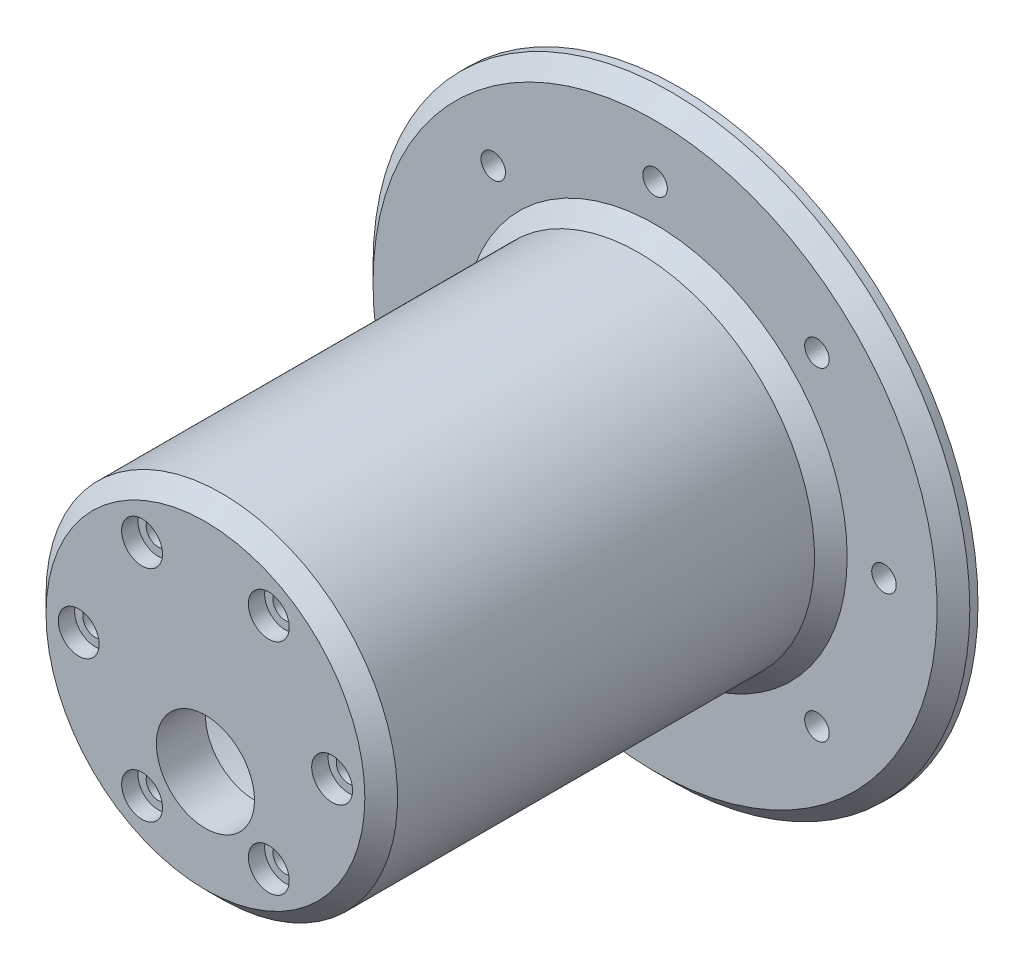
ISO-10303-21;
HEADER;
FILE_DESCRIPTION(('STEP AP214'),'2;1');
FILE_NAME('part.step','',(''),(''),'','','');
FILE_SCHEMA(('AUTOMOTIVE_DESIGN { 1 0 10303 214 1 1 1 1 }'));
ENDSEC;
DATA;
#1=APPLICATION_CONTEXT('core data for automotive mechanical design processes');
#2=APPLICATION_PROTOCOL_DEFINITION('international standard','automotive_design',2000,#1);
#3=PRODUCT_CONTEXT('',#1,'mechanical');
#4=PRODUCT('Part','Part','',(#3));
#5=PRODUCT_RELATED_PRODUCT_CATEGORY('part','',(#4));
#6=PRODUCT_DEFINITION_FORMATION('','',#4);
#7=PRODUCT_DEFINITION_CONTEXT('part definition',#1,'design');
#8=PRODUCT_DEFINITION('design','',#6,#7);
#9=PRODUCT_DEFINITION_SHAPE('','',#8);
#10=(LENGTH_UNIT() NAMED_UNIT(*) SI_UNIT(.MILLI.,.METRE.));
#11=(NAMED_UNIT(*) PLANE_ANGLE_UNIT() SI_UNIT($,.RADIAN.));
#12=(NAMED_UNIT(*) SI_UNIT($,.STERADIAN.) SOLID_ANGLE_UNIT());
#13=UNCERTAINTY_MEASURE_WITH_UNIT(LENGTH_MEASURE(1.E-05),#10,'distance_accuracy_value','');
#14=(GEOMETRIC_REPRESENTATION_CONTEXT(3) GLOBAL_UNCERTAINTY_ASSIGNED_CONTEXT((#13)) GLOBAL_UNIT_ASSIGNED_CONTEXT((#10,
#11,#12)) REPRESENTATION_CONTEXT('',''));
#15=CARTESIAN_POINT('',(0.,0.,0.));
#16=DIRECTION('',(0.,0.,1.));
#17=DIRECTION('',(1.,0.,0.));
#18=AXIS2_PLACEMENT_3D('',#15,#16,#17);
#19=CARTESIAN_POINT('',(0.,36.5,-49.));
#20=DIRECTION('',(0.,0.,-1.));
#21=DIRECTION('',(-1.,0.,0.));
#22=AXIS2_PLACEMENT_3D('',#19,#20,#21);
#23=PLANE('',#22);
#24=CARTESIAN_POINT('',(0.,0.,-49.));
#25=DIRECTION('',(0.,0.,-1.));
#26=DIRECTION('',(-1.,0.,0.));
#27=AXIS2_PLACEMENT_3D('',#24,#25,#26);
#28=CIRCLE('',#27,34.5);
#29=CARTESIAN_POINT('',(-34.5,0.,-49.));
#30=VERTEX_POINT('',#29);
#31=EDGE_CURVE('E52',#30,#30,#28,.F.);
#32=ORIENTED_EDGE('',*,*,#31,.T.);
#33=EDGE_LOOP('',(#32));
#34=FACE_BOUND('',#33,.T.);
#35=CARTESIAN_POINT('',(0.,0.,-49.));
#36=DIRECTION('',(0.,0.,-1.));
#37=DIRECTION('',(-1.,0.,0.));
#38=AXIS2_PLACEMENT_3D('',#35,#36,#37);
#39=CIRCLE('',#38,23.5);
#40=CARTESIAN_POINT('',(-23.5,0.,-49.));
#41=VERTEX_POINT('',#40);
#42=EDGE_CURVE('E47',#41,#41,#39,.T.);
#43=ORIENTED_EDGE('',*,*,#42,.T.);
#44=EDGE_LOOP('',(#43));
#45=FACE_BOUND('',#44,.T.);
#46=CARTESIAN_POINT('',(0.,28.,-49.));
#47=DIRECTION('',(0.,0.,1.));
#48=DIRECTION('',(1.,0.,0.));
#49=AXIS2_PLACEMENT_3D('',#46,#47,#48);
#50=CIRCLE('',#49,1.49999999999999);
#51=CARTESIAN_POINT('',(1.49999999999999,28.,-49.));
#52=VERTEX_POINT('',#51);
#53=EDGE_CURVE('E160',#52,#52,#50,.T.);
#54=ORIENTED_EDGE('',*,*,#53,.F.);
#55=EDGE_LOOP('',(#54));
#56=FACE_BOUND('',#55,.T.);
#57=CARTESIAN_POINT('',(-19.7989898732234,19.7989898732233,-49.));
#58=DIRECTION('',(0.,0.,1.));
#59=DIRECTION('',(1.,0.,0.));
#60=AXIS2_PLACEMENT_3D('',#57,#58,#59);
#61=CIRCLE('',#60,1.49999999999999);
#62=CARTESIAN_POINT('',(-18.2989898732234,19.7989898732233,-49.));
#63=VERTEX_POINT('',#62);
#64=EDGE_CURVE('E166',#63,#63,#61,.T.);
#65=ORIENTED_EDGE('',*,*,#64,.F.);
#66=EDGE_LOOP('',(#65));
#67=FACE_BOUND('',#66,.T.);
#68=CARTESIAN_POINT('',(-28.,0.,-49.));
#69=DIRECTION('',(0.,0.,1.));
#70=DIRECTION('',(1.,0.,0.));
#71=AXIS2_PLACEMENT_3D('',#68,#69,#70);
#72=CIRCLE('',#71,1.49999999999999);
#73=CARTESIAN_POINT('',(-26.5,0.,-49.));
#74=VERTEX_POINT('',#73);
#75=EDGE_CURVE('E172',#74,#74,#72,.T.);
#76=ORIENTED_EDGE('',*,*,#75,.F.);
#77=EDGE_LOOP('',(#76));
#78=FACE_BOUND('',#77,.T.);
#79=CARTESIAN_POINT('',(-19.7989898732232,-19.7989898732234,-49.));
#80=DIRECTION('',(0.,0.,1.));
#81=DIRECTION('',(1.,0.,0.));
#82=AXIS2_PLACEMENT_3D('',#79,#80,#81);
#83=CIRCLE('',#82,1.49999999999999);
#84=CARTESIAN_POINT('',(-18.2989898732232,-19.7989898732234,-49.));
#85=VERTEX_POINT('',#84);
#86=EDGE_CURVE('E178',#85,#85,#83,.T.);
#87=ORIENTED_EDGE('',*,*,#86,.F.);
#88=EDGE_LOOP('',(#87));
#89=FACE_BOUND('',#88,.T.);
#90=CARTESIAN_POINT('',(0.,-28.,-49.));
#91=DIRECTION('',(0.,0.,1.));
#92=DIRECTION('',(1.,0.,0.));
#93=AXIS2_PLACEMENT_3D('',#90,#91,#92);
#94=CIRCLE('',#93,1.49999999999999);
#95=CARTESIAN_POINT('',(1.49999999999999,-28.,-49.));
#96=VERTEX_POINT('',#95);
#97=EDGE_CURVE('E184',#96,#96,#94,.T.);
#98=ORIENTED_EDGE('',*,*,#97,.F.);
#99=EDGE_LOOP('',(#98));
#100=FACE_BOUND('',#99,.T.);
#101=CARTESIAN_POINT('',(19.7989898732235,-19.7989898732232,-49.));
#102=DIRECTION('',(0.,0.,1.));
#103=DIRECTION('',(1.,0.,0.));
#104=AXIS2_PLACEMENT_3D('',#101,#102,#103);
#105=CIRCLE('',#104,1.49999999999999);
#106=CARTESIAN_POINT('',(21.2989898732235,-19.7989898732232,-49.));
#107=VERTEX_POINT('',#106);
#108=EDGE_CURVE('E190',#107,#107,#105,.T.);
#109=ORIENTED_EDGE('',*,*,#108,.F.);
#110=EDGE_LOOP('',(#109));
#111=FACE_BOUND('',#110,.T.);
#112=CARTESIAN_POINT('',(28.,2.93284432462823E-13,-49.));
#113=DIRECTION('',(0.,0.,1.));
#114=DIRECTION('',(1.,0.,0.));
#115=AXIS2_PLACEMENT_3D('',#112,#113,#114);
#116=CIRCLE('',#115,1.49999999999999);
#117=CARTESIAN_POINT('',(29.5,2.93284432462823E-13,-49.));
#118=VERTEX_POINT('',#117);
#119=EDGE_CURVE('E196',#118,#118,#116,.T.);
#120=ORIENTED_EDGE('',*,*,#119,.F.);
#121=EDGE_LOOP('',(#120));
#122=FACE_BOUND('',#121,.T.);
#123=CARTESIAN_POINT('',(19.7989898732231,19.7989898732236,-49.));
#124=DIRECTION('',(0.,0.,1.));
#125=DIRECTION('',(1.,0.,0.));
#126=AXIS2_PLACEMENT_3D('',#123,#124,#125);
#127=CIRCLE('',#126,1.49999999999999);
#128=CARTESIAN_POINT('',(21.2989898732231,19.7989898732236,-49.));
#129=VERTEX_POINT('',#128);
#130=EDGE_CURVE('E202',#129,#129,#127,.T.);
#131=ORIENTED_EDGE('',*,*,#130,.F.);
#132=EDGE_LOOP('',(#131));
#133=FACE_BOUND('',#132,.T.);
#134=ADVANCED_FACE('F35',(#34,#45,#56,#67,#78,#89,#100,#111,#122,#133),#23,.F.);
#135=CARTESIAN_POINT('',(0.,0.,0.));
#136=DIRECTION('',(0.,0.,1.));
#137=DIRECTION('',(1.,0.,0.));
#138=AXIS2_PLACEMENT_3D('',#135,#136,#137);
#139=PLANE('',#138);
#140=CARTESIAN_POINT('',(0.,-7.,0.));
#141=DIRECTION('',(0.,0.,1.));
#142=DIRECTION('',(1.,0.,0.));
#143=AXIS2_PLACEMENT_3D('',#140,#141,#142);
#144=CIRCLE('',#143,6.);
#145=CARTESIAN_POINT('',(6.,-7.,0.));
#146=VERTEX_POINT('',#145);
#147=EDGE_CURVE('E154',#146,#146,#144,.T.);
#148=ORIENTED_EDGE('',*,*,#147,.T.);
#149=EDGE_LOOP('',(#148));
#150=FACE_BOUND('',#149,.T.);
#151=CARTESIAN_POINT('',(7.75000000000016,-13.4233937586587,0.));
#152=DIRECTION('',(0.,0.,1.));
#153=DIRECTION('',(1.,0.,0.));
#154=AXIS2_PLACEMENT_3D('',#151,#152,#153);
#155=CIRCLE('',#154,1.5);
#156=CARTESIAN_POINT('',(9.25000000000015,-13.4233937586587,0.));
#157=VERTEX_POINT('',#156);
#158=EDGE_CURVE('E62',#157,#157,#155,.T.);
#159=ORIENTED_EDGE('',*,*,#158,.T.);
#160=EDGE_LOOP('',(#159));
#161=FACE_BOUND('',#160,.T.);
#162=CARTESIAN_POINT('',(-7.74999999999987,-13.4233937586589,0.));
#163=DIRECTION('',(0.,0.,1.));
#164=DIRECTION('',(1.,0.,0.));
#165=AXIS2_PLACEMENT_3D('',#162,#163,#164);
#166=CIRCLE('',#165,1.49999999999999);
#167=CARTESIAN_POINT('',(-6.24999999999988,-13.4233937586589,0.));
#168=VERTEX_POINT('',#167);
#169=EDGE_CURVE('E67',#168,#168,#166,.T.);
#170=ORIENTED_EDGE('',*,*,#169,.T.);
#171=EDGE_LOOP('',(#170));
#172=FACE_BOUND('',#171,.T.);
#173=CARTESIAN_POINT('',(-15.5,0.,0.));
#174=DIRECTION('',(0.,0.,1.));
#175=DIRECTION('',(1.,0.,0.));
#176=AXIS2_PLACEMENT_3D('',#173,#174,#175);
#177=CIRCLE('',#176,1.5);
#178=CARTESIAN_POINT('',(-14.,0.,0.));
#179=VERTEX_POINT('',#178);
#180=EDGE_CURVE('E72',#179,#179,#177,.T.);
#181=ORIENTED_EDGE('',*,*,#180,.T.);
#182=EDGE_LOOP('',(#181));
#183=FACE_BOUND('',#182,.T.);
#184=CARTESIAN_POINT('',(-7.75000000000006,13.4233937586588,0.));
#185=DIRECTION('',(0.,0.,1.));
#186=DIRECTION('',(1.,0.,0.));
#187=AXIS2_PLACEMENT_3D('',#184,#185,#186);
#188=CIRCLE('',#187,1.49999999999999);
#189=CARTESIAN_POINT('',(-6.25000000000007,13.4233937586588,0.));
#190=VERTEX_POINT('',#189);
#191=EDGE_CURVE('E77',#190,#190,#188,.T.);
#192=ORIENTED_EDGE('',*,*,#191,.T.);
#193=EDGE_LOOP('',(#192));
#194=FACE_BOUND('',#193,.T.);
#195=CARTESIAN_POINT('',(7.74999999999997,13.4233937586588,0.));
#196=DIRECTION('',(0.,0.,1.));
#197=DIRECTION('',(1.,0.,0.));
#198=AXIS2_PLACEMENT_3D('',#195,#196,#197);
#199=CIRCLE('',#198,1.5);
#200=CARTESIAN_POINT('',(9.24999999999996,13.4233937586588,0.));
#201=VERTEX_POINT('',#200);
#202=EDGE_CURVE('E82',#201,#201,#199,.T.);
#203=ORIENTED_EDGE('',*,*,#202,.T.);
#204=EDGE_LOOP('',(#203));
#205=FACE_BOUND('',#204,.T.);
#206=CARTESIAN_POINT('',(15.5,0.,0.));
#207=DIRECTION('',(0.,0.,1.));
#208=DIRECTION('',(1.,0.,0.));
#209=AXIS2_PLACEMENT_3D('',#206,#207,#208);
#210=CIRCLE('',#209,1.5);
#211=CARTESIAN_POINT('',(17.,0.,0.));
#212=VERTEX_POINT('',#211);
#213=EDGE_CURVE('E87',#212,#212,#210,.T.);
#214=ORIENTED_EDGE('',*,*,#213,.T.);
#215=EDGE_LOOP('',(#214));
#216=FACE_BOUND('',#215,.T.);
#217=CARTESIAN_POINT('',(0.,0.,0.));
#218=DIRECTION('',(0.,0.,1.));
#219=DIRECTION('',(1.,0.,0.));
#220=AXIS2_PLACEMENT_3D('',#217,#218,#219);
#221=CIRCLE('',#220,18.5);
#222=CARTESIAN_POINT('',(18.5,0.,0.));
#223=VERTEX_POINT('',#222);
#224=EDGE_CURVE('E61',#223,#223,#221,.T.);
#225=ORIENTED_EDGE('',*,*,#224,.F.);
#226=EDGE_LOOP('',(#225));
#227=FACE_BOUND('',#226,.T.);
#228=ADVANCED_FACE('F210',(#150,#161,#172,#183,#194,#205,#216,#227),#139,.F.);
#229=CARTESIAN_POINT('',(0.,0.,6.));
#230=DIRECTION('',(0.,0.,1.));
#231=DIRECTION('',(1.,0.,0.));
#232=AXIS2_PLACEMENT_3D('',#229,#230,#231);
#233=CYLINDRICAL_SURFACE('',#232,18.5);
#234=CARTESIAN_POINT('',(0.,0.,-52.));
#235=DIRECTION('',(0.,0.,1.));
#236=DIRECTION('',(1.,0.,0.));
#237=AXIS2_PLACEMENT_3D('',#234,#235,#236);
#238=CIRCLE('',#237,18.5);
#239=CARTESIAN_POINT('',(18.5,0.,-52.));
#240=VERTEX_POINT('',#239);
#241=EDGE_CURVE('E94',#240,#240,#238,.T.);
#242=ORIENTED_EDGE('',*,*,#241,.F.);
#243=EDGE_LOOP('',(#242));
#244=FACE_BOUND('',#243,.T.);
#245=ORIENTED_EDGE('',*,*,#224,.T.);
#246=EDGE_LOOP('',(#245));
#247=FACE_BOUND('',#246,.T.);
#248=ADVANCED_FACE('F216',(#244,#247),#233,.F.);
#249=CARTESIAN_POINT('',(0.,18.5,-52.));
#250=DIRECTION('',(0.,0.,1.));
#251=DIRECTION('',(1.,0.,0.));
#252=AXIS2_PLACEMENT_3D('',#249,#250,#251);
#253=PLANE('',#252);
#254=CARTESIAN_POINT('',(0.,0.,-52.));
#255=DIRECTION('',(0.,0.,1.));
#256=DIRECTION('',(1.,0.,0.));
#257=AXIS2_PLACEMENT_3D('',#254,#255,#256);
#258=CIRCLE('',#257,23.5);
#259=CARTESIAN_POINT('',(23.5,0.,-52.));
#260=VERTEX_POINT('',#259);
#261=EDGE_CURVE('E97',#260,#260,#258,.T.);
#262=ORIENTED_EDGE('',*,*,#261,.F.);
#263=EDGE_LOOP('',(#262));
#264=FACE_BOUND('',#263,.T.);
#265=ORIENTED_EDGE('',*,*,#241,.T.);
#266=EDGE_LOOP('',(#265));
#267=FACE_BOUND('',#266,.T.);
#268=ADVANCED_FACE('F243',(#264,#267),#253,.F.);
#269=CARTESIAN_POINT('',(0.,0.,6.));
#270=DIRECTION('',(0.,0.,1.));
#271=DIRECTION('',(1.,0.,0.));
#272=AXIS2_PLACEMENT_3D('',#269,#270,#271);
#273=CYLINDRICAL_SURFACE('',#272,23.5);
#274=CARTESIAN_POINT('',(0.,0.,-51.));
#275=DIRECTION('',(0.,0.,1.));
#276=DIRECTION('',(1.,0.,0.));
#277=AXIS2_PLACEMENT_3D('',#274,#275,#276);
#278=CIRCLE('',#277,23.5);
#279=CARTESIAN_POINT('',(23.5,0.,-51.));
#280=VERTEX_POINT('',#279);
#281=EDGE_CURVE('E100',#280,#280,#278,.T.);
#282=ORIENTED_EDGE('',*,*,#281,.F.);
#283=EDGE_LOOP('',(#282));
#284=FACE_BOUND('',#283,.T.);
#285=ORIENTED_EDGE('',*,*,#261,.T.);
#286=EDGE_LOOP('',(#285));
#287=FACE_BOUND('',#286,.T.);
#288=ADVANCED_FACE('F239',(#284,#287),#273,.T.);
#289=CARTESIAN_POINT('',(0.,23.5,-51.));
#290=DIRECTION('',(0.,0.,1.));
#291=DIRECTION('',(1.,0.,0.));
#292=AXIS2_PLACEMENT_3D('',#289,#290,#291);
#293=PLANE('',#292);
#294=CARTESIAN_POINT('',(0.,0.,-51.));
#295=DIRECTION('',(0.,0.,1.));
#296=DIRECTION('',(1.,0.,0.));
#297=AXIS2_PLACEMENT_3D('',#294,#295,#296);
#298=CIRCLE('',#297,25.5);
#299=CARTESIAN_POINT('',(25.5,0.,-51.));
#300=VERTEX_POINT('',#299);
#301=EDGE_CURVE('E103',#300,#300,#298,.T.);
#302=ORIENTED_EDGE('',*,*,#301,.F.);
#303=EDGE_LOOP('',(#302));
#304=FACE_BOUND('',#303,.T.);
#305=ORIENTED_EDGE('',*,*,#281,.T.);
#306=EDGE_LOOP('',(#305));
#307=FACE_BOUND('',#306,.T.);
#308=ADVANCED_FACE('F235',(#304,#307),#293,.F.);
#309=CARTESIAN_POINT('',(0.,0.,6.));
#310=DIRECTION('',(0.,0.,1.));
#311=DIRECTION('',(1.,0.,0.));
#312=AXIS2_PLACEMENT_3D('',#309,#310,#311);
#313=CYLINDRICAL_SURFACE('',#312,25.5);
#314=CARTESIAN_POINT('',(0.,0.,-52.));
#315=DIRECTION('',(0.,0.,1.));
#316=DIRECTION('',(1.,0.,0.));
#317=AXIS2_PLACEMENT_3D('',#314,#315,#316);
#318=CIRCLE('',#317,25.5);
#319=CARTESIAN_POINT('',(25.5,0.,-52.));
#320=VERTEX_POINT('',#319);
#321=EDGE_CURVE('E106',#320,#320,#318,.T.);
#322=ORIENTED_EDGE('',*,*,#321,.F.);
#323=EDGE_LOOP('',(#322));
#324=FACE_BOUND('',#323,.T.);
#325=ORIENTED_EDGE('',*,*,#301,.T.);
#326=EDGE_LOOP('',(#325));
#327=FACE_BOUND('',#326,.T.);
#328=ADVANCED_FACE('F231',(#324,#327),#313,.F.);
#329=CARTESIAN_POINT('',(0.,25.5,-52.));
#330=DIRECTION('',(0.,0.,1.));
#331=DIRECTION('',(1.,0.,0.));
#332=AXIS2_PLACEMENT_3D('',#329,#330,#331);
#333=PLANE('',#332);
#334=CARTESIAN_POINT('',(19.7989898732231,19.7989898732236,-52.));
#335=DIRECTION('',(0.,0.,1.));
#336=DIRECTION('',(1.,0.,0.));
#337=AXIS2_PLACEMENT_3D('',#334,#335,#336);
#338=CIRCLE('',#337,1.49999999999999);
#339=CARTESIAN_POINT('',(21.2989898732231,19.7989898732236,-52.));
#340=VERTEX_POINT('',#339);
#341=EDGE_CURVE('E199',#340,#340,#338,.T.);
#342=ORIENTED_EDGE('',*,*,#341,.T.);
#343=EDGE_LOOP('',(#342));
#344=FACE_BOUND('',#343,.T.);
#345=CARTESIAN_POINT('',(28.,2.93284432462823E-13,-52.));
#346=DIRECTION('',(0.,0.,1.));
#347=DIRECTION('',(1.,0.,0.));
#348=AXIS2_PLACEMENT_3D('',#345,#346,#347);
#349=CIRCLE('',#348,1.49999999999999);
#350=CARTESIAN_POINT('',(29.5,2.93284432462823E-13,-52.));
#351=VERTEX_POINT('',#350);
#352=EDGE_CURVE('E193',#351,#351,#349,.T.);
#353=ORIENTED_EDGE('',*,*,#352,.T.);
#354=EDGE_LOOP('',(#353));
#355=FACE_BOUND('',#354,.T.);
#356=CARTESIAN_POINT('',(19.7989898732235,-19.7989898732232,-52.));
#357=DIRECTION('',(0.,0.,1.));
#358=DIRECTION('',(1.,0.,0.));
#359=AXIS2_PLACEMENT_3D('',#356,#357,#358);
#360=CIRCLE('',#359,1.49999999999999);
#361=CARTESIAN_POINT('',(21.2989898732235,-19.7989898732232,-52.));
#362=VERTEX_POINT('',#361);
#363=EDGE_CURVE('E187',#362,#362,#360,.T.);
#364=ORIENTED_EDGE('',*,*,#363,.T.);
#365=EDGE_LOOP('',(#364));
#366=FACE_BOUND('',#365,.T.);
#367=CARTESIAN_POINT('',(0.,-28.,-52.));
#368=DIRECTION('',(0.,0.,1.));
#369=DIRECTION('',(1.,0.,0.));
#370=AXIS2_PLACEMENT_3D('',#367,#368,#369);
#371=CIRCLE('',#370,1.49999999999999);
#372=CARTESIAN_POINT('',(1.49999999999999,-28.,-52.));
#373=VERTEX_POINT('',#372);
#374=EDGE_CURVE('E181',#373,#373,#371,.T.);
#375=ORIENTED_EDGE('',*,*,#374,.T.);
#376=EDGE_LOOP('',(#375));
#377=FACE_BOUND('',#376,.T.);
#378=CARTESIAN_POINT('',(-19.7989898732232,-19.7989898732234,-52.));
#379=DIRECTION('',(0.,0.,1.));
#380=DIRECTION('',(1.,0.,0.));
#381=AXIS2_PLACEMENT_3D('',#378,#379,#380);
#382=CIRCLE('',#381,1.49999999999999);
#383=CARTESIAN_POINT('',(-18.2989898732232,-19.7989898732234,-52.));
#384=VERTEX_POINT('',#383);
#385=EDGE_CURVE('E175',#384,#384,#382,.T.);
#386=ORIENTED_EDGE('',*,*,#385,.T.);
#387=EDGE_LOOP('',(#386));
#388=FACE_BOUND('',#387,.T.);
#389=CARTESIAN_POINT('',(-28.,0.,-52.));
#390=DIRECTION('',(0.,0.,1.));
#391=DIRECTION('',(1.,0.,0.));
#392=AXIS2_PLACEMENT_3D('',#389,#390,#391);
#393=CIRCLE('',#392,1.49999999999999);
#394=CARTESIAN_POINT('',(-26.5,0.,-52.));
#395=VERTEX_POINT('',#394);
#396=EDGE_CURVE('E169',#395,#395,#393,.T.);
#397=ORIENTED_EDGE('',*,*,#396,.T.);
#398=EDGE_LOOP('',(#397));
#399=FACE_BOUND('',#398,.T.);
#400=CARTESIAN_POINT('',(-19.7989898732234,19.7989898732233,-52.));
#401=DIRECTION('',(0.,0.,1.));
#402=DIRECTION('',(1.,0.,0.));
#403=AXIS2_PLACEMENT_3D('',#400,#401,#402);
#404=CIRCLE('',#403,1.49999999999999);
#405=CARTESIAN_POINT('',(-18.2989898732234,19.7989898732233,-52.));
#406=VERTEX_POINT('',#405);
#407=EDGE_CURVE('E163',#406,#406,#404,.T.);
#408=ORIENTED_EDGE('',*,*,#407,.T.);
#409=EDGE_LOOP('',(#408));
#410=FACE_BOUND('',#409,.T.);
#411=CARTESIAN_POINT('',(0.,28.,-52.));
#412=DIRECTION('',(0.,0.,1.));
#413=DIRECTION('',(1.,0.,0.));
#414=AXIS2_PLACEMENT_3D('',#411,#412,#413);
#415=CIRCLE('',#414,1.49999999999999);
#416=CARTESIAN_POINT('',(1.49999999999999,28.,-52.));
#417=VERTEX_POINT('',#416);
#418=EDGE_CURVE('E39',#417,#417,#415,.T.);
#419=ORIENTED_EDGE('',*,*,#418,.T.);
#420=EDGE_LOOP('',(#419));
#421=FACE_BOUND('',#420,.T.);
#422=CARTESIAN_POINT('',(0.,0.,-52.));
#423=DIRECTION('',(0.,0.,1.));
#424=DIRECTION('',(1.,0.,0.));
#425=AXIS2_PLACEMENT_3D('',#422,#423,#424);
#426=CIRCLE('',#425,36.5);
#427=CARTESIAN_POINT('',(36.5,0.,-52.));
#428=VERTEX_POINT('',#427);
#429=EDGE_CURVE('E90',#428,#428,#426,.T.);
#430=ORIENTED_EDGE('',*,*,#429,.F.);
#431=EDGE_LOOP('',(#430));
#432=FACE_BOUND('',#431,.T.);
#433=ORIENTED_EDGE('',*,*,#321,.T.);
#434=EDGE_LOOP('',(#433));
#435=FACE_BOUND('',#434,.T.);
#436=ADVANCED_FACE('F227',(#344,#355,#366,#377,#388,#399,#410,#421,#432,#435),#333,.F.);
#437=CARTESIAN_POINT('',(0.,0.,6.));
#438=DIRECTION('',(0.,0.,1.));
#439=DIRECTION('',(1.,0.,0.));
#440=AXIS2_PLACEMENT_3D('',#437,#438,#439);
#441=CYLINDRICAL_SURFACE('',#440,36.5);
#442=CARTESIAN_POINT('',(0.,0.,-51.));
#443=DIRECTION('',(0.,0.,-1.));
#444=DIRECTION('',(-1.,0.,0.));
#445=AXIS2_PLACEMENT_3D('',#442,#443,#444);
#446=CIRCLE('',#445,36.5);
#447=CARTESIAN_POINT('',(-36.5,0.,-51.));
#448=VERTEX_POINT('',#447);
#449=EDGE_CURVE('E43',#448,#448,#446,.T.);
#450=ORIENTED_EDGE('',*,*,#449,.T.);
#451=EDGE_LOOP('',(#450));
#452=FACE_BOUND('',#451,.T.);
#453=ORIENTED_EDGE('',*,*,#429,.T.);
#454=EDGE_LOOP('',(#453));
#455=FACE_BOUND('',#454,.T.);
#456=ADVANCED_FACE('F224',(#452,#455),#441,.T.);
#457=CARTESIAN_POINT('',(0.,0.,6.));
#458=DIRECTION('',(0.,0.,1.));
#459=DIRECTION('',(1.,0.,0.));
#460=AXIS2_PLACEMENT_3D('',#457,#458,#459);
#461=CYLINDRICAL_SURFACE('',#460,21.5);
#462=CARTESIAN_POINT('',(0.,0.,-47.));
#463=DIRECTION('',(0.,0.,-1.));
#464=DIRECTION('',(-1.,0.,0.));
#465=AXIS2_PLACEMENT_3D('',#462,#463,#464);
#466=CIRCLE('',#465,21.5);
#467=CARTESIAN_POINT('',(-21.5,0.,-47.));
#468=VERTEX_POINT('',#467);
#469=EDGE_CURVE('E55',#468,#468,#466,.F.);
#470=ORIENTED_EDGE('',*,*,#469,.T.);
#471=EDGE_LOOP('',(#470));
#472=FACE_BOUND('',#471,.T.);
#473=CARTESIAN_POINT('',(0.,0.,3.99999999999998));
#474=DIRECTION('',(0.,0.,-1.));
#475=DIRECTION('',(-1.,0.,0.));
#476=AXIS2_PLACEMENT_3D('',#473,#474,#475);
#477=CIRCLE('',#476,21.5);
#478=CARTESIAN_POINT('',(-21.5,0.,3.99999999999998));
#479=VERTEX_POINT('',#478);
#480=EDGE_CURVE('E58',#479,#479,#477,.T.);
#481=ORIENTED_EDGE('',*,*,#480,.T.);
#482=EDGE_LOOP('',(#481));
#483=FACE_BOUND('',#482,.T.);
#484=ADVANCED_FACE('F222',(#472,#483),#461,.T.);
#485=CARTESIAN_POINT('',(0.,21.5,6.));
#486=DIRECTION('',(0.,0.,-1.));
#487=DIRECTION('',(-1.,0.,0.));
#488=AXIS2_PLACEMENT_3D('',#485,#486,#487);
#489=PLANE('',#488);
#490=CARTESIAN_POINT('',(0.,0.,6.));
#491=DIRECTION('',(0.,0.,-1.));
#492=DIRECTION('',(-1.,0.,0.));
#493=AXIS2_PLACEMENT_3D('',#490,#491,#492);
#494=CIRCLE('',#493,19.5);
#495=CARTESIAN_POINT('',(-19.5,0.,6.));
#496=VERTEX_POINT('',#495);
#497=EDGE_CURVE('E10',#496,#496,#494,.F.);
#498=ORIENTED_EDGE('',*,*,#497,.T.);
#499=EDGE_LOOP('',(#498));
#500=FACE_BOUND('',#499,.T.);
#501=CARTESIAN_POINT('',(0.,-7.,6.));
#502=DIRECTION('',(0.,0.,1.));
#503=DIRECTION('',(1.,0.,0.));
#504=AXIS2_PLACEMENT_3D('',#501,#502,#503);
#505=CIRCLE('',#504,6.);
#506=CARTESIAN_POINT('',(6.,-7.,6.));
#507=VERTEX_POINT('',#506);
#508=EDGE_CURVE('E157',#507,#507,#505,.T.);
#509=ORIENTED_EDGE('',*,*,#508,.F.);
#510=EDGE_LOOP('',(#509));
#511=FACE_BOUND('',#510,.T.);
#512=CARTESIAN_POINT('',(7.75000000000016,-13.4233937586587,6.));
#513=DIRECTION('',(0.,0.,1.));
#514=DIRECTION('',(1.,0.,0.));
#515=AXIS2_PLACEMENT_3D('',#512,#513,#514);
#516=CIRCLE('',#515,2.5);
#517=CARTESIAN_POINT('',(10.2500000000002,-13.4233937586587,6.));
#518=VERTEX_POINT('',#517);
#519=EDGE_CURVE('E151',#518,#518,#516,.T.);
#520=ORIENTED_EDGE('',*,*,#519,.F.);
#521=EDGE_LOOP('',(#520));
#522=FACE_BOUND('',#521,.T.);
#523=CARTESIAN_POINT('',(-7.74999999999987,-13.4233937586589,6.));
#524=DIRECTION('',(0.,0.,1.));
#525=DIRECTION('',(1.,0.,0.));
#526=AXIS2_PLACEMENT_3D('',#523,#524,#525);
#527=CIRCLE('',#526,2.5);
#528=CARTESIAN_POINT('',(-5.24999999999987,-13.4233937586589,6.));
#529=VERTEX_POINT('',#528);
#530=EDGE_CURVE('E65',#529,#529,#527,.T.);
#531=ORIENTED_EDGE('',*,*,#530,.F.);
#532=EDGE_LOOP('',(#531));
#533=FACE_BOUND('',#532,.T.);
#534=CARTESIAN_POINT('',(-15.5,0.,6.));
#535=DIRECTION('',(0.,0.,1.));
#536=DIRECTION('',(1.,0.,0.));
#537=AXIS2_PLACEMENT_3D('',#534,#535,#536);
#538=CIRCLE('',#537,2.5);
#539=CARTESIAN_POINT('',(-13.,0.,6.));
#540=VERTEX_POINT('',#539);
#541=EDGE_CURVE('E70',#540,#540,#538,.T.);
#542=ORIENTED_EDGE('',*,*,#541,.F.);
#543=EDGE_LOOP('',(#542));
#544=FACE_BOUND('',#543,.T.);
#545=CARTESIAN_POINT('',(-7.75000000000006,13.4233937586588,6.));
#546=DIRECTION('',(0.,0.,1.));
#547=DIRECTION('',(1.,0.,0.));
#548=AXIS2_PLACEMENT_3D('',#545,#546,#547);
#549=CIRCLE('',#548,2.5);
#550=CARTESIAN_POINT('',(-5.25000000000006,13.4233937586588,6.));
#551=VERTEX_POINT('',#550);
#552=EDGE_CURVE('E75',#551,#551,#549,.T.);
#553=ORIENTED_EDGE('',*,*,#552,.F.);
#554=EDGE_LOOP('',(#553));
#555=FACE_BOUND('',#554,.T.);
#556=CARTESIAN_POINT('',(7.74999999999997,13.4233937586588,6.));
#557=DIRECTION('',(0.,0.,1.));
#558=DIRECTION('',(1.,0.,0.));
#559=AXIS2_PLACEMENT_3D('',#556,#557,#558);
#560=CIRCLE('',#559,2.5);
#561=CARTESIAN_POINT('',(10.25,13.4233937586588,6.));
#562=VERTEX_POINT('',#561);
#563=EDGE_CURVE('E80',#562,#562,#560,.T.);
#564=ORIENTED_EDGE('',*,*,#563,.F.);
#565=EDGE_LOOP('',(#564));
#566=FACE_BOUND('',#565,.T.);
#567=CARTESIAN_POINT('',(15.5,0.,6.));
#568=DIRECTION('',(0.,0.,1.));
#569=DIRECTION('',(1.,0.,0.));
#570=AXIS2_PLACEMENT_3D('',#567,#568,#569);
#571=CIRCLE('',#570,2.5);
#572=CARTESIAN_POINT('',(18.,0.,6.));
#573=VERTEX_POINT('',#572);
#574=EDGE_CURVE('E85',#573,#573,#571,.T.);
#575=ORIENTED_EDGE('',*,*,#574,.F.);
#576=EDGE_LOOP('',(#575));
#577=FACE_BOUND('',#576,.T.);
#578=ADVANCED_FACE('F292',(#500,#511,#522,#533,#544,#555,#566,#577),#489,.F.);
#579=CARTESIAN_POINT('',(15.5,0.,6.));
#580=DIRECTION('',(0.,0.,1.));
#581=DIRECTION('',(1.,0.,0.));
#582=AXIS2_PLACEMENT_3D('',#579,#580,#581);
#583=CYLINDRICAL_SURFACE('',#582,1.5);
#584=CARTESIAN_POINT('',(15.5,0.,4.));
#585=DIRECTION('',(0.,0.,1.));
#586=DIRECTION('',(1.,0.,0.));
#587=AXIS2_PLACEMENT_3D('',#584,#585,#586);
#588=CIRCLE('',#587,1.5);
#589=CARTESIAN_POINT('',(17.,0.,4.));
#590=VERTEX_POINT('',#589);
#591=EDGE_CURVE('E91',#590,#590,#588,.T.);
#592=ORIENTED_EDGE('',*,*,#591,.T.);
#593=EDGE_LOOP('',(#592));
#594=FACE_BOUND('',#593,.T.);
#595=ORIENTED_EDGE('',*,*,#213,.F.);
#596=EDGE_LOOP('',(#595));
#597=FACE_BOUND('',#596,.T.);
#598=ADVANCED_FACE('F297',(#594,#597),#583,.F.);
#599=CARTESIAN_POINT('',(17.,0.,4.));
#600=DIRECTION('',(0.,0.,-1.));
#601=DIRECTION('',(-1.,0.,0.));
#602=AXIS2_PLACEMENT_3D('',#599,#600,#601);
#603=PLANE('',#602);
#604=ORIENTED_EDGE('',*,*,#591,.F.);
#605=EDGE_LOOP('',(#604));
#606=FACE_BOUND('',#605,.T.);
#607=CARTESIAN_POINT('',(15.5,0.,4.));
#608=DIRECTION('',(0.,0.,1.));
#609=DIRECTION('',(1.,0.,0.));
#610=AXIS2_PLACEMENT_3D('',#607,#608,#609);
#611=CIRCLE('',#610,2.5);
#612=CARTESIAN_POINT('',(18.,0.,4.));
#613=VERTEX_POINT('',#612);
#614=EDGE_CURVE('E113',#613,#613,#611,.T.);
#615=ORIENTED_EDGE('',*,*,#614,.T.);
#616=EDGE_LOOP('',(#615));
#617=FACE_BOUND('',#616,.T.);
#618=ADVANCED_FACE('F303',(#606,#617),#603,.F.);
#619=CARTESIAN_POINT('',(15.5,0.,6.));
#620=DIRECTION('',(0.,0.,1.));
#621=DIRECTION('',(1.,0.,0.));
#622=AXIS2_PLACEMENT_3D('',#619,#620,#621);
#623=CYLINDRICAL_SURFACE('',#622,2.5);
#624=ORIENTED_EDGE('',*,*,#614,.F.);
#625=EDGE_LOOP('',(#624));
#626=FACE_BOUND('',#625,.T.);
#627=ORIENTED_EDGE('',*,*,#574,.T.);
#628=EDGE_LOOP('',(#627));
#629=FACE_BOUND('',#628,.T.);
#630=ADVANCED_FACE('F310',(#626,#629),#623,.F.);
#631=CARTESIAN_POINT('',(7.74999999999997,13.4233937586588,6.));
#632=DIRECTION('',(0.,0.,1.));
#633=DIRECTION('',(1.,0.,0.));
#634=AXIS2_PLACEMENT_3D('',#631,#632,#633);
#635=CYLINDRICAL_SURFACE('',#634,1.5);
#636=CARTESIAN_POINT('',(7.74999999999997,13.4233937586588,4.));
#637=DIRECTION('',(0.,0.,1.));
#638=DIRECTION('',(1.,0.,0.));
#639=AXIS2_PLACEMENT_3D('',#636,#637,#638);
#640=CIRCLE('',#639,1.5);
#641=CARTESIAN_POINT('',(9.24999999999997,13.4233937586588,4.));
#642=VERTEX_POINT('',#641);
#643=EDGE_CURVE('E86',#642,#642,#640,.T.);
#644=ORIENTED_EDGE('',*,*,#643,.T.);
#645=EDGE_LOOP('',(#644));
#646=FACE_BOUND('',#645,.T.);
#647=ORIENTED_EDGE('',*,*,#202,.F.);
#648=EDGE_LOOP('',(#647));
#649=FACE_BOUND('',#648,.T.);
#650=ADVANCED_FACE('F314',(#646,#649),#635,.F.);
#651=CARTESIAN_POINT('',(9.24999999999997,13.4233937586588,4.));
#652=DIRECTION('',(0.,0.,-1.));
#653=DIRECTION('',(-1.,0.,0.));
#654=AXIS2_PLACEMENT_3D('',#651,#652,#653);
#655=PLANE('',#654);
#656=ORIENTED_EDGE('',*,*,#643,.F.);
#657=EDGE_LOOP('',(#656));
#658=FACE_BOUND('',#657,.T.);
#659=CARTESIAN_POINT('',(7.74999999999997,13.4233937586588,4.));
#660=DIRECTION('',(0.,0.,1.));
#661=DIRECTION('',(1.,0.,0.));
#662=AXIS2_PLACEMENT_3D('',#659,#660,#661);
#663=CIRCLE('',#662,2.5);
#664=CARTESIAN_POINT('',(10.25,13.4233937586588,4.));
#665=VERTEX_POINT('',#664);
#666=EDGE_CURVE('E120',#665,#665,#663,.T.);
#667=ORIENTED_EDGE('',*,*,#666,.T.);
#668=EDGE_LOOP('',(#667));
#669=FACE_BOUND('',#668,.T.);
#670=ADVANCED_FACE('F318',(#658,#669),#655,.F.);
#671=CARTESIAN_POINT('',(7.74999999999997,13.4233937586588,6.));
#672=DIRECTION('',(0.,0.,1.));
#673=DIRECTION('',(1.,0.,0.));
#674=AXIS2_PLACEMENT_3D('',#671,#672,#673);
#675=CYLINDRICAL_SURFACE('',#674,2.5);
#676=ORIENTED_EDGE('',*,*,#666,.F.);
#677=EDGE_LOOP('',(#676));
#678=FACE_BOUND('',#677,.T.);
#679=ORIENTED_EDGE('',*,*,#563,.T.);
#680=EDGE_LOOP('',(#679));
#681=FACE_BOUND('',#680,.T.);
#682=ADVANCED_FACE('F322',(#678,#681),#675,.F.);
#683=CARTESIAN_POINT('',(-7.75000000000006,13.4233937586588,6.));
#684=DIRECTION('',(0.,0.,1.));
#685=DIRECTION('',(1.,0.,0.));
#686=AXIS2_PLACEMENT_3D('',#683,#684,#685);
#687=CYLINDRICAL_SURFACE('',#686,1.49999999999999);
#688=CARTESIAN_POINT('',(-7.75000000000006,13.4233937586588,4.));
#689=DIRECTION('',(0.,0.,1.));
#690=DIRECTION('',(1.,0.,0.));
#691=AXIS2_PLACEMENT_3D('',#688,#689,#690);
#692=CIRCLE('',#691,1.5);
#693=CARTESIAN_POINT('',(-6.25000000000006,13.4233937586588,4.));
#694=VERTEX_POINT('',#693);
#695=EDGE_CURVE('E81',#694,#694,#692,.T.);
#696=ORIENTED_EDGE('',*,*,#695,.T.);
#697=EDGE_LOOP('',(#696));
#698=FACE_BOUND('',#697,.T.);
#699=ORIENTED_EDGE('',*,*,#191,.F.);
#700=EDGE_LOOP('',(#699));
#701=FACE_BOUND('',#700,.T.);
#702=ADVANCED_FACE('F326',(#698,#701),#687,.F.);
#703=CARTESIAN_POINT('',(-6.25000000000006,13.4233937586588,4.));
#704=DIRECTION('',(0.,0.,-1.));
#705=DIRECTION('',(-1.,0.,0.));
#706=AXIS2_PLACEMENT_3D('',#703,#704,#705);
#707=PLANE('',#706);
#708=ORIENTED_EDGE('',*,*,#695,.F.);
#709=EDGE_LOOP('',(#708));
#710=FACE_BOUND('',#709,.T.);
#711=CARTESIAN_POINT('',(-7.75000000000006,13.4233937586588,4.));
#712=DIRECTION('',(0.,0.,1.));
#713=DIRECTION('',(1.,0.,0.));
#714=AXIS2_PLACEMENT_3D('',#711,#712,#713);
#715=CIRCLE('',#714,2.5);
#716=CARTESIAN_POINT('',(-5.25000000000006,13.4233937586588,4.));
#717=VERTEX_POINT('',#716);
#718=EDGE_CURVE('E127',#717,#717,#715,.T.);
#719=ORIENTED_EDGE('',*,*,#718,.T.);
#720=EDGE_LOOP('',(#719));
#721=FACE_BOUND('',#720,.T.);
#722=ADVANCED_FACE('F330',(#710,#721),#707,.F.);
#723=CARTESIAN_POINT('',(-7.75000000000006,13.4233937586588,6.));
#724=DIRECTION('',(0.,0.,1.));
#725=DIRECTION('',(1.,0.,0.));
#726=AXIS2_PLACEMENT_3D('',#723,#724,#725);
#727=CYLINDRICAL_SURFACE('',#726,2.5);
#728=ORIENTED_EDGE('',*,*,#718,.F.);
#729=EDGE_LOOP('',(#728));
#730=FACE_BOUND('',#729,.T.);
#731=ORIENTED_EDGE('',*,*,#552,.T.);
#732=EDGE_LOOP('',(#731));
#733=FACE_BOUND('',#732,.T.);
#734=ADVANCED_FACE('F334',(#730,#733),#727,.F.);
#735=CARTESIAN_POINT('',(-15.5,0.,6.));
#736=DIRECTION('',(0.,0.,1.));
#737=DIRECTION('',(1.,0.,0.));
#738=AXIS2_PLACEMENT_3D('',#735,#736,#737);
#739=CYLINDRICAL_SURFACE('',#738,1.5);
#740=CARTESIAN_POINT('',(-15.5,0.,4.));
#741=DIRECTION('',(0.,0.,1.));
#742=DIRECTION('',(1.,0.,0.));
#743=AXIS2_PLACEMENT_3D('',#740,#741,#742);
#744=CIRCLE('',#743,1.5);
#745=CARTESIAN_POINT('',(-14.,0.,4.));
#746=VERTEX_POINT('',#745);
#747=EDGE_CURVE('E76',#746,#746,#744,.T.);
#748=ORIENTED_EDGE('',*,*,#747,.T.);
#749=EDGE_LOOP('',(#748));
#750=FACE_BOUND('',#749,.T.);
#751=ORIENTED_EDGE('',*,*,#180,.F.);
#752=EDGE_LOOP('',(#751));
#753=FACE_BOUND('',#752,.T.);
#754=ADVANCED_FACE('F338',(#750,#753),#739,.F.);
#755=CARTESIAN_POINT('',(-14.,0.,4.));
#756=DIRECTION('',(0.,0.,-1.));
#757=DIRECTION('',(-1.,0.,0.));
#758=AXIS2_PLACEMENT_3D('',#755,#756,#757);
#759=PLANE('',#758);
#760=ORIENTED_EDGE('',*,*,#747,.F.);
#761=EDGE_LOOP('',(#760));
#762=FACE_BOUND('',#761,.T.);
#763=CARTESIAN_POINT('',(-15.5,0.,4.));
#764=DIRECTION('',(0.,0.,1.));
#765=DIRECTION('',(1.,0.,0.));
#766=AXIS2_PLACEMENT_3D('',#763,#764,#765);
#767=CIRCLE('',#766,2.5);
#768=CARTESIAN_POINT('',(-13.,0.,4.));
#769=VERTEX_POINT('',#768);
#770=EDGE_CURVE('E134',#769,#769,#767,.T.);
#771=ORIENTED_EDGE('',*,*,#770,.T.);
#772=EDGE_LOOP('',(#771));
#773=FACE_BOUND('',#772,.T.);
#774=ADVANCED_FACE('F342',(#762,#773),#759,.F.);
#775=CARTESIAN_POINT('',(-15.5,0.,6.));
#776=DIRECTION('',(0.,0.,1.));
#777=DIRECTION('',(1.,0.,0.));
#778=AXIS2_PLACEMENT_3D('',#775,#776,#777);
#779=CYLINDRICAL_SURFACE('',#778,2.5);
#780=ORIENTED_EDGE('',*,*,#770,.F.);
#781=EDGE_LOOP('',(#780));
#782=FACE_BOUND('',#781,.T.);
#783=ORIENTED_EDGE('',*,*,#541,.T.);
#784=EDGE_LOOP('',(#783));
#785=FACE_BOUND('',#784,.T.);
#786=ADVANCED_FACE('F346',(#782,#785),#779,.F.);
#787=CARTESIAN_POINT('',(-7.74999999999987,-13.4233937586589,6.));
#788=DIRECTION('',(0.,0.,1.));
#789=DIRECTION('',(1.,0.,0.));
#790=AXIS2_PLACEMENT_3D('',#787,#788,#789);
#791=CYLINDRICAL_SURFACE('',#790,1.49999999999999);
#792=CARTESIAN_POINT('',(-7.74999999999987,-13.4233937586589,4.));
#793=DIRECTION('',(0.,0.,1.));
#794=DIRECTION('',(1.,0.,0.));
#795=AXIS2_PLACEMENT_3D('',#792,#793,#794);
#796=CIRCLE('',#795,1.5);
#797=CARTESIAN_POINT('',(-6.24999999999987,-13.4233937586589,4.));
#798=VERTEX_POINT('',#797);
#799=EDGE_CURVE('E71',#798,#798,#796,.T.);
#800=ORIENTED_EDGE('',*,*,#799,.T.);
#801=EDGE_LOOP('',(#800));
#802=FACE_BOUND('',#801,.T.);
#803=ORIENTED_EDGE('',*,*,#169,.F.);
#804=EDGE_LOOP('',(#803));
#805=FACE_BOUND('',#804,.T.);
#806=ADVANCED_FACE('F350',(#802,#805),#791,.F.);
#807=CARTESIAN_POINT('',(-6.24999999999987,-13.4233937586589,4.));
#808=DIRECTION('',(0.,0.,-1.));
#809=DIRECTION('',(-1.,0.,0.));
#810=AXIS2_PLACEMENT_3D('',#807,#808,#809);
#811=PLANE('',#810);
#812=ORIENTED_EDGE('',*,*,#799,.F.);
#813=EDGE_LOOP('',(#812));
#814=FACE_BOUND('',#813,.T.);
#815=CARTESIAN_POINT('',(-7.74999999999987,-13.4233937586589,4.));
#816=DIRECTION('',(0.,0.,1.));
#817=DIRECTION('',(1.,0.,0.));
#818=AXIS2_PLACEMENT_3D('',#815,#816,#817);
#819=CIRCLE('',#818,2.5);
#820=CARTESIAN_POINT('',(-5.24999999999988,-13.4233937586589,4.));
#821=VERTEX_POINT('',#820);
#822=EDGE_CURVE('E141',#821,#821,#819,.T.);
#823=ORIENTED_EDGE('',*,*,#822,.T.);
#824=EDGE_LOOP('',(#823));
#825=FACE_BOUND('',#824,.T.);
#826=ADVANCED_FACE('F354',(#814,#825),#811,.F.);
#827=CARTESIAN_POINT('',(-7.74999999999987,-13.4233937586589,6.));
#828=DIRECTION('',(0.,0.,1.));
#829=DIRECTION('',(1.,0.,0.));
#830=AXIS2_PLACEMENT_3D('',#827,#828,#829);
#831=CYLINDRICAL_SURFACE('',#830,2.5);
#832=ORIENTED_EDGE('',*,*,#822,.F.);
#833=EDGE_LOOP('',(#832));
#834=FACE_BOUND('',#833,.T.);
#835=ORIENTED_EDGE('',*,*,#530,.T.);
#836=EDGE_LOOP('',(#835));
#837=FACE_BOUND('',#836,.T.);
#838=ADVANCED_FACE('F358',(#834,#837),#831,.F.);
#839=CARTESIAN_POINT('',(7.75000000000016,-13.4233937586587,6.));
#840=DIRECTION('',(0.,0.,1.));
#841=DIRECTION('',(1.,0.,0.));
#842=AXIS2_PLACEMENT_3D('',#839,#840,#841);
#843=CYLINDRICAL_SURFACE('',#842,1.5);
#844=CARTESIAN_POINT('',(7.75000000000016,-13.4233937586587,4.));
#845=DIRECTION('',(0.,0.,1.));
#846=DIRECTION('',(1.,0.,0.));
#847=AXIS2_PLACEMENT_3D('',#844,#845,#846);
#848=CIRCLE('',#847,1.5);
#849=CARTESIAN_POINT('',(9.25000000000016,-13.4233937586587,4.));
#850=VERTEX_POINT('',#849);
#851=EDGE_CURVE('E66',#850,#850,#848,.T.);
#852=ORIENTED_EDGE('',*,*,#851,.T.);
#853=EDGE_LOOP('',(#852));
#854=FACE_BOUND('',#853,.T.);
#855=ORIENTED_EDGE('',*,*,#158,.F.);
#856=EDGE_LOOP('',(#855));
#857=FACE_BOUND('',#856,.T.);
#858=ADVANCED_FACE('F362',(#854,#857),#843,.F.);
#859=CARTESIAN_POINT('',(9.25000000000016,-13.4233937586587,4.));
#860=DIRECTION('',(0.,0.,-1.));
#861=DIRECTION('',(-1.,0.,0.));
#862=AXIS2_PLACEMENT_3D('',#859,#860,#861);
#863=PLANE('',#862);
#864=ORIENTED_EDGE('',*,*,#851,.F.);
#865=EDGE_LOOP('',(#864));
#866=FACE_BOUND('',#865,.T.);
#867=CARTESIAN_POINT('',(7.75000000000016,-13.4233937586587,4.));
#868=DIRECTION('',(0.,0.,1.));
#869=DIRECTION('',(1.,0.,0.));
#870=AXIS2_PLACEMENT_3D('',#867,#868,#869);
#871=CIRCLE('',#870,2.5);
#872=CARTESIAN_POINT('',(10.2500000000002,-13.4233937586587,4.));
#873=VERTEX_POINT('',#872);
#874=EDGE_CURVE('E148',#873,#873,#871,.T.);
#875=ORIENTED_EDGE('',*,*,#874,.T.);
#876=EDGE_LOOP('',(#875));
#877=FACE_BOUND('',#876,.T.);
#878=ADVANCED_FACE('F366',(#866,#877),#863,.F.);
#879=CARTESIAN_POINT('',(7.75000000000016,-13.4233937586587,6.));
#880=DIRECTION('',(0.,0.,1.));
#881=DIRECTION('',(1.,0.,0.));
#882=AXIS2_PLACEMENT_3D('',#879,#880,#881);
#883=CYLINDRICAL_SURFACE('',#882,2.5);
#884=ORIENTED_EDGE('',*,*,#874,.F.);
#885=EDGE_LOOP('',(#884));
#886=FACE_BOUND('',#885,.T.);
#887=ORIENTED_EDGE('',*,*,#519,.T.);
#888=EDGE_LOOP('',(#887));
#889=FACE_BOUND('',#888,.T.);
#890=ADVANCED_FACE('F370',(#886,#889),#883,.F.);
#891=CARTESIAN_POINT('',(0.,-7.,6.));
#892=DIRECTION('',(0.,0.,1.));
#893=DIRECTION('',(1.,0.,0.));
#894=AXIS2_PLACEMENT_3D('',#891,#892,#893);
#895=CYLINDRICAL_SURFACE('',#894,6.);
#896=ORIENTED_EDGE('',*,*,#508,.T.);
#897=EDGE_LOOP('',(#896));
#898=FACE_BOUND('',#897,.T.);
#899=ORIENTED_EDGE('',*,*,#147,.F.);
#900=EDGE_LOOP('',(#899));
#901=FACE_BOUND('',#900,.T.);
#902=ADVANCED_FACE('F254',(#898,#901),#895,.F.);
#903=CARTESIAN_POINT('',(0.,0.,-47.));
#904=DIRECTION('',(0.,0.,-1.));
#905=DIRECTION('',(-1.,0.,0.));
#906=AXIS2_PLACEMENT_3D('',#903,#904,#905);
#907=CONICAL_SURFACE('',#906,21.5,0.785398163397441);
#908=ORIENTED_EDGE('',*,*,#42,.F.);
#909=EDGE_LOOP('',(#908));
#910=FACE_BOUND('',#909,.T.);
#911=ORIENTED_EDGE('',*,*,#469,.F.);
#912=EDGE_LOOP('',(#911));
#913=FACE_BOUND('',#912,.T.);
#914=ADVANCED_FACE('F251',(#910,#913),#907,.T.);
#915=CARTESIAN_POINT('',(0.,0.,-49.));
#916=DIRECTION('',(0.,0.,-1.));
#917=DIRECTION('',(-1.,0.,0.));
#918=AXIS2_PLACEMENT_3D('',#915,#916,#917);
#919=CONICAL_SURFACE('',#918,34.5,0.785398163397448);
#920=ORIENTED_EDGE('',*,*,#449,.F.);
#921=EDGE_LOOP('',(#920));
#922=FACE_BOUND('',#921,.T.);
#923=ORIENTED_EDGE('',*,*,#31,.F.);
#924=EDGE_LOOP('',(#923));
#925=FACE_BOUND('',#924,.T.);
#926=ADVANCED_FACE('F253',(#922,#925),#919,.T.);
#927=CARTESIAN_POINT('',(0.,0.,6.));
#928=DIRECTION('',(0.,0.,-1.));
#929=DIRECTION('',(-1.,0.,0.));
#930=AXIS2_PLACEMENT_3D('',#927,#928,#929);
#931=CONICAL_SURFACE('',#930,19.5,0.785398163397444);
#932=ORIENTED_EDGE('',*,*,#480,.F.);
#933=EDGE_LOOP('',(#932));
#934=FACE_BOUND('',#933,.T.);
#935=ORIENTED_EDGE('',*,*,#497,.F.);
#936=EDGE_LOOP('',(#935));
#937=FACE_BOUND('',#936,.T.);
#938=ADVANCED_FACE('F37',(#934,#937),#931,.T.);
#939=CARTESIAN_POINT('',(0.,28.,-49.));
#940=DIRECTION('',(0.,0.,1.));
#941=DIRECTION('',(1.,0.,0.));
#942=AXIS2_PLACEMENT_3D('',#939,#940,#941);
#943=CYLINDRICAL_SURFACE('',#942,1.49999999999999);
#944=ORIENTED_EDGE('',*,*,#53,.T.);
#945=EDGE_LOOP('',(#944));
#946=FACE_BOUND('',#945,.T.);
#947=ORIENTED_EDGE('',*,*,#418,.F.);
#948=EDGE_LOOP('',(#947));
#949=FACE_BOUND('',#948,.T.);
#950=ADVANCED_FACE('F261',(#946,#949),#943,.F.);
#951=CARTESIAN_POINT('',(-19.7989898732234,19.7989898732233,-49.));
#952=DIRECTION('',(0.,0.,1.));
#953=DIRECTION('',(1.,0.,0.));
#954=AXIS2_PLACEMENT_3D('',#951,#952,#953);
#955=CYLINDRICAL_SURFACE('',#954,1.49999999999999);
#956=ORIENTED_EDGE('',*,*,#64,.T.);
#957=EDGE_LOOP('',(#956));
#958=FACE_BOUND('',#957,.T.);
#959=ORIENTED_EDGE('',*,*,#407,.F.);
#960=EDGE_LOOP('',(#959));
#961=FACE_BOUND('',#960,.T.);
#962=ADVANCED_FACE('F285',(#958,#961),#955,.F.);
#963=CARTESIAN_POINT('',(-28.,0.,-49.));
#964=DIRECTION('',(0.,0.,1.));
#965=DIRECTION('',(1.,0.,0.));
#966=AXIS2_PLACEMENT_3D('',#963,#964,#965);
#967=CYLINDRICAL_SURFACE('',#966,1.49999999999999);
#968=ORIENTED_EDGE('',*,*,#75,.T.);
#969=EDGE_LOOP('',(#968));
#970=FACE_BOUND('',#969,.T.);
#971=ORIENTED_EDGE('',*,*,#396,.F.);
#972=EDGE_LOOP('',(#971));
#973=FACE_BOUND('',#972,.T.);
#974=ADVANCED_FACE('F380',(#970,#973),#967,.F.);
#975=CARTESIAN_POINT('',(-19.7989898732232,-19.7989898732234,-49.));
#976=DIRECTION('',(0.,0.,1.));
#977=DIRECTION('',(1.,0.,0.));
#978=AXIS2_PLACEMENT_3D('',#975,#976,#977);
#979=CYLINDRICAL_SURFACE('',#978,1.49999999999999);
#980=ORIENTED_EDGE('',*,*,#86,.T.);
#981=EDGE_LOOP('',(#980));
#982=FACE_BOUND('',#981,.T.);
#983=ORIENTED_EDGE('',*,*,#385,.F.);
#984=EDGE_LOOP('',(#983));
#985=FACE_BOUND('',#984,.T.);
#986=ADVANCED_FACE('F384',(#982,#985),#979,.F.);
#987=CARTESIAN_POINT('',(0.,-28.,-49.));
#988=DIRECTION('',(0.,0.,1.));
#989=DIRECTION('',(1.,0.,0.));
#990=AXIS2_PLACEMENT_3D('',#987,#988,#989);
#991=CYLINDRICAL_SURFACE('',#990,1.49999999999999);
#992=ORIENTED_EDGE('',*,*,#97,.T.);
#993=EDGE_LOOP('',(#992));
#994=FACE_BOUND('',#993,.T.);
#995=ORIENTED_EDGE('',*,*,#374,.F.);
#996=EDGE_LOOP('',(#995));
#997=FACE_BOUND('',#996,.T.);
#998=ADVANCED_FACE('F388',(#994,#997),#991,.F.);
#999=CARTESIAN_POINT('',(19.7989898732235,-19.7989898732232,-49.));
#1000=DIRECTION('',(0.,0.,1.));
#1001=DIRECTION('',(1.,0.,0.));
#1002=AXIS2_PLACEMENT_3D('',#999,#1000,#1001);
#1003=CYLINDRICAL_SURFACE('',#1002,1.49999999999999);
#1004=ORIENTED_EDGE('',*,*,#108,.T.);
#1005=EDGE_LOOP('',(#1004));
#1006=FACE_BOUND('',#1005,.T.);
#1007=ORIENTED_EDGE('',*,*,#363,.F.);
#1008=EDGE_LOOP('',(#1007));
#1009=FACE_BOUND('',#1008,.T.);
#1010=ADVANCED_FACE('F392',(#1006,#1009),#1003,.F.);
#1011=CARTESIAN_POINT('',(28.,2.93284432462823E-13,-49.));
#1012=DIRECTION('',(0.,0.,1.));
#1013=DIRECTION('',(1.,0.,0.));
#1014=AXIS2_PLACEMENT_3D('',#1011,#1012,#1013);
#1015=CYLINDRICAL_SURFACE('',#1014,1.49999999999999);
#1016=ORIENTED_EDGE('',*,*,#119,.T.);
#1017=EDGE_LOOP('',(#1016));
#1018=FACE_BOUND('',#1017,.T.);
#1019=ORIENTED_EDGE('',*,*,#352,.F.);
#1020=EDGE_LOOP('',(#1019));
#1021=FACE_BOUND('',#1020,.T.);
#1022=ADVANCED_FACE('F396',(#1018,#1021),#1015,.F.);
#1023=CARTESIAN_POINT('',(19.7989898732231,19.7989898732236,-49.));
#1024=DIRECTION('',(0.,0.,1.));
#1025=DIRECTION('',(1.,0.,0.));
#1026=AXIS2_PLACEMENT_3D('',#1023,#1024,#1025);
#1027=CYLINDRICAL_SURFACE('',#1026,1.49999999999999);
#1028=ORIENTED_EDGE('',*,*,#130,.T.);
#1029=EDGE_LOOP('',(#1028));
#1030=FACE_BOUND('',#1029,.T.);
#1031=ORIENTED_EDGE('',*,*,#341,.F.);
#1032=EDGE_LOOP('',(#1031));
#1033=FACE_BOUND('',#1032,.T.);
#1034=ADVANCED_FACE('F206',(#1030,#1033),#1027,.F.);
#1035=CLOSED_SHELL('',(#134,#228,#248,#268,#288,#308,#328,#436,#456,#484,#578,#598,#618,#630,
#650,#670,#682,#702,#722,#734,#754,#774,#786,#806,#826,#838,#858,#878,#890,#902,#914,#926,#938,
#950,#962,#974,#986,#998,#1010,#1022,#1034));
#1036=MANIFOLD_SOLID_BREP('B2',#1035);
#1037=ADVANCED_BREP_SHAPE_REPRESENTATION('',(#18,#1036),#14);
#1038=SHAPE_DEFINITION_REPRESENTATION(#9,#1037);
ENDSEC;
END-ISO-10303-21;
